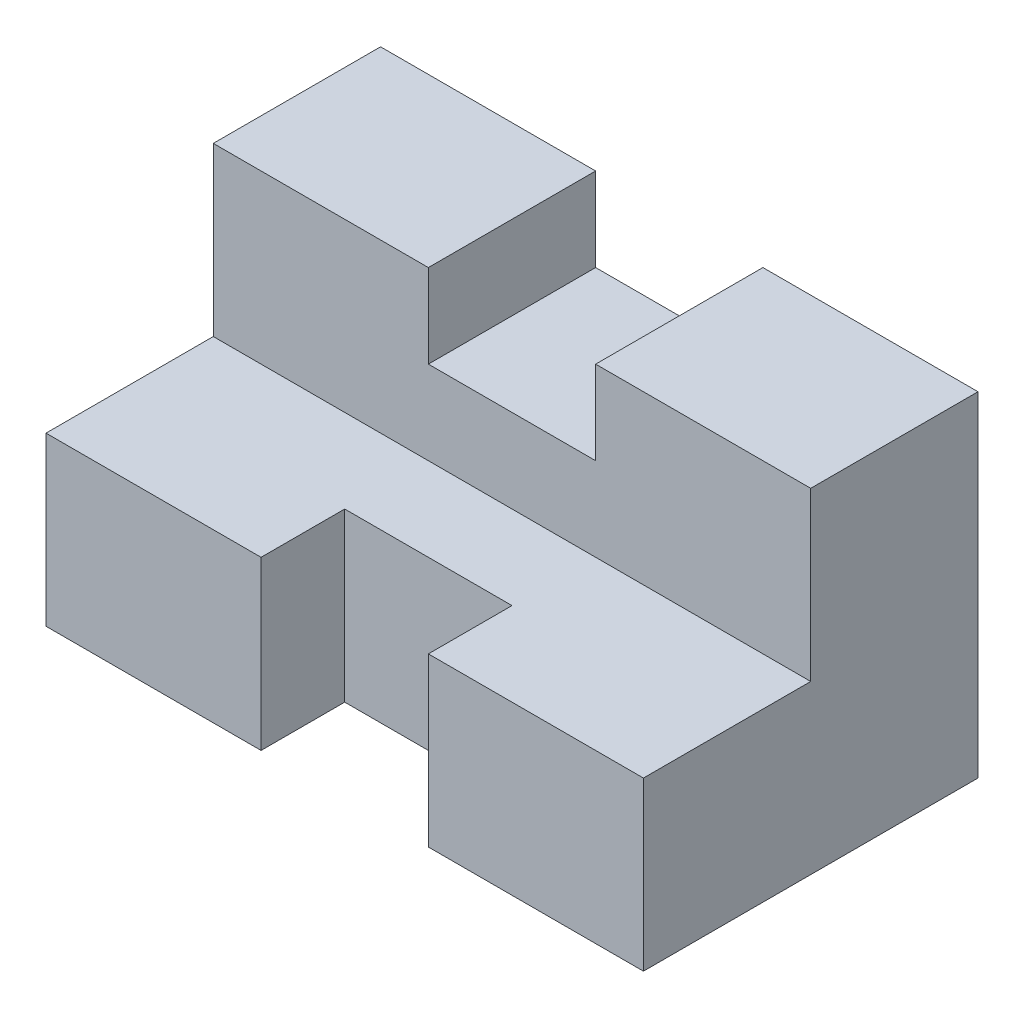
ISO-10303-21;
HEADER;
FILE_DESCRIPTION(('STEP AP214'),'2;1');
FILE_NAME('part.step','',(''),(''),'','','');
FILE_SCHEMA(('AUTOMOTIVE_DESIGN { 1 0 10303 214 1 1 1 1 }'));
ENDSEC;
DATA;
#1=APPLICATION_CONTEXT('core data for automotive mechanical design processes');
#2=APPLICATION_PROTOCOL_DEFINITION('international standard','automotive_design',2000,#1);
#3=PRODUCT_CONTEXT('',#1,'mechanical');
#4=PRODUCT('Part','Part','',(#3));
#5=PRODUCT_RELATED_PRODUCT_CATEGORY('part','',(#4));
#6=PRODUCT_DEFINITION_FORMATION('','',#4);
#7=PRODUCT_DEFINITION_CONTEXT('part definition',#1,'design');
#8=PRODUCT_DEFINITION('design','',#6,#7);
#9=PRODUCT_DEFINITION_SHAPE('','',#8);
#10=(LENGTH_UNIT() NAMED_UNIT(*) SI_UNIT(.MILLI.,.METRE.));
#11=(NAMED_UNIT(*) PLANE_ANGLE_UNIT() SI_UNIT($,.RADIAN.));
#12=(NAMED_UNIT(*) SI_UNIT($,.STERADIAN.) SOLID_ANGLE_UNIT());
#13=UNCERTAINTY_MEASURE_WITH_UNIT(LENGTH_MEASURE(1.E-05),#10,'distance_accuracy_value','');
#14=(GEOMETRIC_REPRESENTATION_CONTEXT(3) GLOBAL_UNCERTAINTY_ASSIGNED_CONTEXT((#13)) GLOBAL_UNIT_ASSIGNED_CONTEXT((#10,
#11,#12)) REPRESENTATION_CONTEXT('',''));
#15=CARTESIAN_POINT('',(0.,0.,0.));
#16=DIRECTION('',(0.,0.,1.));
#17=DIRECTION('',(1.,0.,0.));
#18=AXIS2_PLACEMENT_3D('',#15,#16,#17);
#19=CARTESIAN_POINT('',(25.,28.,-28.));
#20=DIRECTION('',(0.,-1.,0.));
#21=DIRECTION('',(0.,0.,-1.));
#22=AXIS2_PLACEMENT_3D('',#19,#20,#21);
#23=PLANE('',#22);
#24=DIRECTION('',(-1.,0.,0.));
#25=VECTOR('',#24,1.);
#26=CARTESIAN_POINT('',(25.,28.,-14.));
#27=LINE('',#26,#25);
#28=CARTESIAN_POINT('',(-7.,28.,-14.));
#29=VERTEX_POINT('',#28);
#30=CARTESIAN_POINT('',(-25.,28.,-14.));
#31=VERTEX_POINT('',#30);
#32=EDGE_CURVE('E223',#29,#31,#27,.T.);
#33=ORIENTED_EDGE('',*,*,#32,.F.);
#34=DIRECTION('',(0.,0.,1.));
#35=VECTOR('',#34,1.);
#36=CARTESIAN_POINT('',(-7.,28.,-28.));
#37=LINE('',#36,#35);
#38=CARTESIAN_POINT('',(-7.,28.,-28.));
#39=VERTEX_POINT('',#38);
#40=EDGE_CURVE('E159',#39,#29,#37,.T.);
#41=ORIENTED_EDGE('',*,*,#40,.F.);
#42=DIRECTION('',(-1.,0.,0.));
#43=VECTOR('',#42,1.);
#44=CARTESIAN_POINT('',(25.,28.,-28.));
#45=LINE('',#44,#43);
#46=CARTESIAN_POINT('',(-25.,28.,-28.));
#47=VERTEX_POINT('',#46);
#48=EDGE_CURVE('E227',#39,#47,#45,.T.);
#49=ORIENTED_EDGE('',*,*,#48,.T.);
#50=DIRECTION('',(0.,0.,1.));
#51=VECTOR('',#50,1.);
#52=CARTESIAN_POINT('',(-25.,28.,-28.));
#53=LINE('',#52,#51);
#54=EDGE_CURVE('E210',#47,#31,#53,.T.);
#55=ORIENTED_EDGE('',*,*,#54,.T.);
#56=EDGE_LOOP('',(#33,#41,#49,#55));
#57=FACE_BOUND('',#56,.T.);
#58=ADVANCED_FACE('F33',(#57),#23,.F.);
#59=CARTESIAN_POINT('',(25.,14.,0.));
#60=DIRECTION('',(0.,0.,-1.));
#61=DIRECTION('',(-1.,0.,0.));
#62=AXIS2_PLACEMENT_3D('',#59,#60,#61);
#63=PLANE('',#62);
#64=DIRECTION('',(0.,-1.,0.));
#65=VECTOR('',#64,1.);
#66=CARTESIAN_POINT('',(7.,28.001,0.));
#67=LINE('',#66,#65);
#68=CARTESIAN_POINT('',(7.,14.,0.));
#69=VERTEX_POINT('',#68);
#70=CARTESIAN_POINT('',(7.,0.,0.));
#71=VERTEX_POINT('',#70);
#72=EDGE_CURVE('E181',#69,#71,#67,.T.);
#73=ORIENTED_EDGE('',*,*,#72,.T.);
#74=DIRECTION('',(-1.,0.,0.));
#75=VECTOR('',#74,1.);
#76=CARTESIAN_POINT('',(25.,0.,0.));
#77=LINE('',#76,#75);
#78=CARTESIAN_POINT('',(25.,0.,0.));
#79=VERTEX_POINT('',#78);
#80=EDGE_CURVE('E234',#79,#71,#77,.T.);
#81=ORIENTED_EDGE('',*,*,#80,.F.);
#82=DIRECTION('',(0.,-1.,0.));
#83=VECTOR('',#82,1.);
#84=CARTESIAN_POINT('',(25.,14.,0.));
#85=LINE('',#84,#83);
#86=CARTESIAN_POINT('',(25.,14.,0.));
#87=VERTEX_POINT('',#86);
#88=EDGE_CURVE('E188',#87,#79,#85,.T.);
#89=ORIENTED_EDGE('',*,*,#88,.F.);
#90=DIRECTION('',(-1.,0.,0.));
#91=VECTOR('',#90,1.);
#92=CARTESIAN_POINT('',(25.,14.,0.));
#93=LINE('',#92,#91);
#94=EDGE_CURVE('E217',#87,#69,#93,.T.);
#95=ORIENTED_EDGE('',*,*,#94,.T.);
#96=EDGE_LOOP('',(#73,#81,#89,#95));
#97=FACE_BOUND('',#96,.T.);
#98=ADVANCED_FACE('F35',(#97),#63,.F.);
#99=DIRECTION('',(0.,-1.,0.));
#100=VECTOR('',#99,1.);
#101=CARTESIAN_POINT('',(-7.,28.001,0.));
#102=LINE('',#101,#100);
#103=CARTESIAN_POINT('',(-7.,14.,0.));
#104=VERTEX_POINT('',#103);
#105=CARTESIAN_POINT('',(-7.,0.,0.));
#106=VERTEX_POINT('',#105);
#107=EDGE_CURVE('E176',#104,#106,#102,.T.);
#108=ORIENTED_EDGE('',*,*,#107,.F.);
#109=CARTESIAN_POINT('',(-25.,14.,0.));
#110=VERTEX_POINT('',#109);
#111=EDGE_CURVE('E202',#104,#110,#93,.T.);
#112=ORIENTED_EDGE('',*,*,#111,.T.);
#113=DIRECTION('',(0.,-1.,0.));
#114=VECTOR('',#113,1.);
#115=CARTESIAN_POINT('',(-25.,14.,0.));
#116=LINE('',#115,#114);
#117=CARTESIAN_POINT('',(-25.,0.,0.));
#118=VERTEX_POINT('',#117);
#119=EDGE_CURVE('E187',#110,#118,#116,.T.);
#120=ORIENTED_EDGE('',*,*,#119,.T.);
#121=EDGE_CURVE('E233',#106,#118,#77,.T.);
#122=ORIENTED_EDGE('',*,*,#121,.F.);
#123=EDGE_LOOP('',(#108,#112,#120,#122));
#124=FACE_BOUND('',#123,.T.);
#125=ADVANCED_FACE('F264',(#124),#63,.F.);
#126=CARTESIAN_POINT('',(25.,0.,0.));
#127=DIRECTION('',(0.,1.,0.));
#128=DIRECTION('',(0.,0.,1.));
#129=AXIS2_PLACEMENT_3D('',#126,#127,#128);
#130=PLANE('',#129);
#131=DIRECTION('',(0.,0.,-1.));
#132=VECTOR('',#131,1.);
#133=CARTESIAN_POINT('',(7.,0.,0.));
#134=LINE('',#133,#132);
#135=CARTESIAN_POINT('',(7.,0.,-7.));
#136=VERTEX_POINT('',#135);
#137=EDGE_CURVE('E167',#71,#136,#134,.T.);
#138=ORIENTED_EDGE('',*,*,#137,.T.);
#139=DIRECTION('',(-1.,0.,0.));
#140=VECTOR('',#139,1.);
#141=CARTESIAN_POINT('',(7.,0.,-7.));
#142=LINE('',#141,#140);
#143=CARTESIAN_POINT('',(-7.,0.,-7.));
#144=VERTEX_POINT('',#143);
#145=EDGE_CURVE('E170',#136,#144,#142,.T.);
#146=ORIENTED_EDGE('',*,*,#145,.T.);
#147=DIRECTION('',(0.,0.,1.));
#148=VECTOR('',#147,1.);
#149=CARTESIAN_POINT('',(-7.,0.,-7.));
#150=LINE('',#149,#148);
#151=EDGE_CURVE('E173',#144,#106,#150,.T.);
#152=ORIENTED_EDGE('',*,*,#151,.T.);
#153=ORIENTED_EDGE('',*,*,#121,.T.);
#154=DIRECTION('',(0.,0.,-1.));
#155=VECTOR('',#154,1.);
#156=CARTESIAN_POINT('',(-25.,0.,0.));
#157=LINE('',#156,#155);
#158=CARTESIAN_POINT('',(-25.,0.,-28.));
#159=VERTEX_POINT('',#158);
#160=EDGE_CURVE('E205',#118,#159,#157,.T.);
#161=ORIENTED_EDGE('',*,*,#160,.T.);
#162=DIRECTION('',(-1.,0.,0.));
#163=VECTOR('',#162,1.);
#164=CARTESIAN_POINT('',(25.,0.,-28.));
#165=LINE('',#164,#163);
#166=CARTESIAN_POINT('',(25.,0.,-28.));
#167=VERTEX_POINT('',#166);
#168=EDGE_CURVE('E230',#167,#159,#165,.T.);
#169=ORIENTED_EDGE('',*,*,#168,.F.);
#170=DIRECTION('',(0.,0.,-1.));
#171=VECTOR('',#170,1.);
#172=CARTESIAN_POINT('',(25.,0.,0.));
#173=LINE('',#172,#171);
#174=EDGE_CURVE('E191',#79,#167,#173,.T.);
#175=ORIENTED_EDGE('',*,*,#174,.F.);
#176=ORIENTED_EDGE('',*,*,#80,.T.);
#177=EDGE_LOOP('',(#138,#146,#152,#153,#161,#169,#175,#176));
#178=FACE_BOUND('',#177,.T.);
#179=ADVANCED_FACE('F254',(#178),#130,.F.);
#180=CARTESIAN_POINT('',(25.,14.,-14.));
#181=DIRECTION('',(0.,-1.,0.));
#182=DIRECTION('',(0.,0.,-1.));
#183=AXIS2_PLACEMENT_3D('',#180,#181,#182);
#184=PLANE('',#183);
#185=DIRECTION('',(0.,0.,1.));
#186=VECTOR('',#185,1.);
#187=CARTESIAN_POINT('',(7.,14.,0.));
#188=LINE('',#187,#186);
#189=CARTESIAN_POINT('',(7.,14.,-7.));
#190=VERTEX_POINT('',#189);
#191=EDGE_CURVE('E164',#190,#69,#188,.T.);
#192=ORIENTED_EDGE('',*,*,#191,.T.);
#193=ORIENTED_EDGE('',*,*,#94,.F.);
#194=DIRECTION('',(0.,0.,1.));
#195=VECTOR('',#194,1.);
#196=CARTESIAN_POINT('',(25.,14.,-14.));
#197=LINE('',#196,#195);
#198=CARTESIAN_POINT('',(25.,14.,-14.));
#199=VERTEX_POINT('',#198);
#200=EDGE_CURVE('E200',#199,#87,#197,.T.);
#201=ORIENTED_EDGE('',*,*,#200,.F.);
#202=DIRECTION('',(-1.,0.,0.));
#203=VECTOR('',#202,1.);
#204=CARTESIAN_POINT('',(25.,14.,-14.));
#205=LINE('',#204,#203);
#206=CARTESIAN_POINT('',(-25.,14.,-14.));
#207=VERTEX_POINT('',#206);
#208=EDGE_CURVE('E220',#199,#207,#205,.T.);
#209=ORIENTED_EDGE('',*,*,#208,.T.);
#210=DIRECTION('',(0.,0.,1.));
#211=VECTOR('',#210,1.);
#212=CARTESIAN_POINT('',(-25.,14.,-14.));
#213=LINE('',#212,#211);
#214=EDGE_CURVE('E192',#207,#110,#213,.T.);
#215=ORIENTED_EDGE('',*,*,#214,.T.);
#216=ORIENTED_EDGE('',*,*,#111,.F.);
#217=DIRECTION('',(0.,0.,-1.));
#218=VECTOR('',#217,1.);
#219=CARTESIAN_POINT('',(-7.,14.,-7.));
#220=LINE('',#219,#218);
#221=CARTESIAN_POINT('',(-7.,14.,-7.));
#222=VERTEX_POINT('',#221);
#223=EDGE_CURVE('E184',#104,#222,#220,.T.);
#224=ORIENTED_EDGE('',*,*,#223,.T.);
#225=DIRECTION('',(1.,0.,0.));
#226=VECTOR('',#225,1.);
#227=CARTESIAN_POINT('',(7.,14.,-7.));
#228=LINE('',#227,#226);
#229=EDGE_CURVE('E158',#222,#190,#228,.T.);
#230=ORIENTED_EDGE('',*,*,#229,.T.);
#231=EDGE_LOOP('',(#192,#193,#201,#209,#215,#216,#224,#230));
#232=FACE_BOUND('',#231,.T.);
#233=ADVANCED_FACE('F267',(#232),#184,.F.);
#234=CARTESIAN_POINT('',(25.,0.,-28.));
#235=DIRECTION('',(0.,0.,1.));
#236=DIRECTION('',(1.,0.,0.));
#237=AXIS2_PLACEMENT_3D('',#234,#235,#236);
#238=PLANE('',#237);
#239=ORIENTED_EDGE('',*,*,#48,.F.);
#240=DIRECTION('',(0.,-1.,0.));
#241=VECTOR('',#240,1.);
#242=CARTESIAN_POINT('',(-7.,21.,-28.));
#243=LINE('',#242,#241);
#244=CARTESIAN_POINT('',(-7.,21.,-28.));
#245=VERTEX_POINT('',#244);
#246=EDGE_CURVE('E141',#39,#245,#243,.T.);
#247=ORIENTED_EDGE('',*,*,#246,.T.);
#248=DIRECTION('',(1.,0.,0.));
#249=VECTOR('',#248,1.);
#250=CARTESIAN_POINT('',(7.,21.,-28.));
#251=LINE('',#250,#249);
#252=CARTESIAN_POINT('',(7.,21.,-28.));
#253=VERTEX_POINT('',#252);
#254=EDGE_CURVE('E136',#245,#253,#251,.T.);
#255=ORIENTED_EDGE('',*,*,#254,.T.);
#256=DIRECTION('',(0.,1.,0.));
#257=VECTOR('',#256,1.);
#258=CARTESIAN_POINT('',(7.,21.,-28.));
#259=LINE('',#258,#257);
#260=CARTESIAN_POINT('',(7.,28.,-28.));
#261=VERTEX_POINT('',#260);
#262=EDGE_CURVE('E144',#253,#261,#259,.T.);
#263=ORIENTED_EDGE('',*,*,#262,.T.);
#264=CARTESIAN_POINT('',(25.,28.,-28.));
#265=VERTEX_POINT('',#264);
#266=EDGE_CURVE('E228',#265,#261,#45,.T.);
#267=ORIENTED_EDGE('',*,*,#266,.F.);
#268=DIRECTION('',(0.,1.,0.));
#269=VECTOR('',#268,1.);
#270=CARTESIAN_POINT('',(25.,0.,-28.));
#271=LINE('',#270,#269);
#272=EDGE_CURVE('E194',#167,#265,#271,.T.);
#273=ORIENTED_EDGE('',*,*,#272,.F.);
#274=ORIENTED_EDGE('',*,*,#168,.T.);
#275=DIRECTION('',(0.,1.,0.));
#276=VECTOR('',#275,1.);
#277=CARTESIAN_POINT('',(-25.,0.,-28.));
#278=LINE('',#277,#276);
#279=EDGE_CURVE('E207',#159,#47,#278,.T.);
#280=ORIENTED_EDGE('',*,*,#279,.T.);
#281=EDGE_LOOP('',(#239,#247,#255,#263,#267,#273,#274,#280));
#282=FACE_BOUND('',#281,.T.);
#283=ADVANCED_FACE('F152',(#282),#238,.F.);
#284=ORIENTED_EDGE('',*,*,#266,.T.);
#285=DIRECTION('',(0.,0.,1.));
#286=VECTOR('',#285,1.);
#287=CARTESIAN_POINT('',(7.,28.,-28.));
#288=LINE('',#287,#286);
#289=CARTESIAN_POINT('',(7.,28.,-14.));
#290=VERTEX_POINT('',#289);
#291=EDGE_CURVE('E140',#261,#290,#288,.T.);
#292=ORIENTED_EDGE('',*,*,#291,.T.);
#293=CARTESIAN_POINT('',(25.,28.,-14.));
#294=VERTEX_POINT('',#293);
#295=EDGE_CURVE('E224',#294,#290,#27,.T.);
#296=ORIENTED_EDGE('',*,*,#295,.F.);
#297=DIRECTION('',(0.,0.,1.));
#298=VECTOR('',#297,1.);
#299=CARTESIAN_POINT('',(25.,28.,-28.));
#300=LINE('',#299,#298);
#301=EDGE_CURVE('E196',#265,#294,#300,.T.);
#302=ORIENTED_EDGE('',*,*,#301,.F.);
#303=EDGE_LOOP('',(#284,#292,#296,#302));
#304=FACE_BOUND('',#303,.T.);
#305=ADVANCED_FACE('F244',(#304),#23,.F.);
#306=CARTESIAN_POINT('',(25.,28.,-14.));
#307=DIRECTION('',(0.,0.,-1.));
#308=DIRECTION('',(0.,1.,0.));
#309=AXIS2_PLACEMENT_3D('',#306,#307,#308);
#310=PLANE('',#309);
#311=DIRECTION('',(-1.,0.,0.));
#312=VECTOR('',#311,1.);
#313=CARTESIAN_POINT('',(25.,21.,-14.));
#314=LINE('',#313,#312);
#315=CARTESIAN_POINT('',(7.,21.,-14.));
#316=VERTEX_POINT('',#315);
#317=CARTESIAN_POINT('',(-7.,21.,-14.));
#318=VERTEX_POINT('',#317);
#319=EDGE_CURVE('E41',#316,#318,#314,.T.);
#320=ORIENTED_EDGE('',*,*,#319,.T.);
#321=DIRECTION('',(0.,1.,0.));
#322=VECTOR('',#321,1.);
#323=CARTESIAN_POINT('',(-7.,28.,-14.));
#324=LINE('',#323,#322);
#325=EDGE_CURVE('E11',#318,#29,#324,.T.);
#326=ORIENTED_EDGE('',*,*,#325,.T.);
#327=ORIENTED_EDGE('',*,*,#32,.T.);
#328=DIRECTION('',(0.,-1.,0.));
#329=VECTOR('',#328,1.);
#330=CARTESIAN_POINT('',(-25.,28.,-14.));
#331=LINE('',#330,#329);
#332=EDGE_CURVE('E213',#31,#207,#331,.T.);
#333=ORIENTED_EDGE('',*,*,#332,.T.);
#334=ORIENTED_EDGE('',*,*,#208,.F.);
#335=DIRECTION('',(0.,-1.,0.));
#336=VECTOR('',#335,1.);
#337=CARTESIAN_POINT('',(25.,28.,-14.));
#338=LINE('',#337,#336);
#339=EDGE_CURVE('E198',#294,#199,#338,.T.);
#340=ORIENTED_EDGE('',*,*,#339,.F.);
#341=ORIENTED_EDGE('',*,*,#295,.T.);
#342=DIRECTION('',(0.,-1.,0.));
#343=VECTOR('',#342,1.);
#344=CARTESIAN_POINT('',(7.,28.,-14.));
#345=LINE('',#344,#343);
#346=EDGE_CURVE('E237',#290,#316,#345,.T.);
#347=ORIENTED_EDGE('',*,*,#346,.T.);
#348=EDGE_LOOP('',(#320,#326,#327,#333,#334,#340,#341,#347));
#349=FACE_BOUND('',#348,.T.);
#350=ADVANCED_FACE('F239',(#349),#310,.F.);
#351=CARTESIAN_POINT('',(25.,0.,0.));
#352=DIRECTION('',(1.,0.,0.));
#353=DIRECTION('',(0.,0.,-1.));
#354=AXIS2_PLACEMENT_3D('',#351,#352,#353);
#355=PLANE('',#354);
#356=ORIENTED_EDGE('',*,*,#88,.T.);
#357=ORIENTED_EDGE('',*,*,#174,.T.);
#358=ORIENTED_EDGE('',*,*,#272,.T.);
#359=ORIENTED_EDGE('',*,*,#301,.T.);
#360=ORIENTED_EDGE('',*,*,#339,.T.);
#361=ORIENTED_EDGE('',*,*,#200,.T.);
#362=EDGE_LOOP('',(#356,#357,#358,#359,#360,#361));
#363=FACE_BOUND('',#362,.T.);
#364=ADVANCED_FACE('F250',(#363),#355,.T.);
#365=CARTESIAN_POINT('',(-25.,0.,0.));
#366=DIRECTION('',(1.,0.,0.));
#367=DIRECTION('',(0.,0.,-1.));
#368=AXIS2_PLACEMENT_3D('',#365,#366,#367);
#369=PLANE('',#368);
#370=ORIENTED_EDGE('',*,*,#119,.F.);
#371=ORIENTED_EDGE('',*,*,#214,.F.);
#372=ORIENTED_EDGE('',*,*,#332,.F.);
#373=ORIENTED_EDGE('',*,*,#54,.F.);
#374=ORIENTED_EDGE('',*,*,#279,.F.);
#375=ORIENTED_EDGE('',*,*,#160,.F.);
#376=EDGE_LOOP('',(#370,#371,#372,#373,#374,#375));
#377=FACE_BOUND('',#376,.T.);
#378=ADVANCED_FACE('F259',(#377),#369,.F.);
#379=CARTESIAN_POINT('',(7.,28.001,0.));
#380=DIRECTION('',(-1.,0.,0.));
#381=DIRECTION('',(0.,0.,1.));
#382=AXIS2_PLACEMENT_3D('',#379,#380,#381);
#383=PLANE('',#382);
#384=DIRECTION('',(0.,-1.,0.));
#385=VECTOR('',#384,1.);
#386=CARTESIAN_POINT('',(7.,28.001,-7.));
#387=LINE('',#386,#385);
#388=EDGE_CURVE('E179',#190,#136,#387,.T.);
#389=ORIENTED_EDGE('',*,*,#388,.T.);
#390=ORIENTED_EDGE('',*,*,#137,.F.);
#391=ORIENTED_EDGE('',*,*,#72,.F.);
#392=ORIENTED_EDGE('',*,*,#191,.F.);
#393=EDGE_LOOP('',(#389,#390,#391,#392));
#394=FACE_BOUND('',#393,.T.);
#395=ADVANCED_FACE('F321',(#394),#383,.T.);
#396=CARTESIAN_POINT('',(7.,28.001,-7.));
#397=DIRECTION('',(0.,0.,1.));
#398=DIRECTION('',(1.,0.,0.));
#399=AXIS2_PLACEMENT_3D('',#396,#397,#398);
#400=PLANE('',#399);
#401=DIRECTION('',(0.,-1.,0.));
#402=VECTOR('',#401,1.);
#403=CARTESIAN_POINT('',(-7.,28.001,-7.));
#404=LINE('',#403,#402);
#405=EDGE_CURVE('E56',#222,#144,#404,.T.);
#406=ORIENTED_EDGE('',*,*,#405,.T.);
#407=ORIENTED_EDGE('',*,*,#145,.F.);
#408=ORIENTED_EDGE('',*,*,#388,.F.);
#409=ORIENTED_EDGE('',*,*,#229,.F.);
#410=EDGE_LOOP('',(#406,#407,#408,#409));
#411=FACE_BOUND('',#410,.T.);
#412=ADVANCED_FACE('F364',(#411),#400,.T.);
#413=CARTESIAN_POINT('',(-7.,28.001,-7.));
#414=DIRECTION('',(1.,0.,0.));
#415=DIRECTION('',(0.,0.,-1.));
#416=AXIS2_PLACEMENT_3D('',#413,#414,#415);
#417=PLANE('',#416);
#418=ORIENTED_EDGE('',*,*,#107,.T.);
#419=ORIENTED_EDGE('',*,*,#151,.F.);
#420=ORIENTED_EDGE('',*,*,#405,.F.);
#421=ORIENTED_EDGE('',*,*,#223,.F.);
#422=EDGE_LOOP('',(#418,#419,#420,#421));
#423=FACE_BOUND('',#422,.T.);
#424=ADVANCED_FACE('F282',(#423),#417,.T.);
#425=CARTESIAN_POINT('',(7.,21.,-28.));
#426=DIRECTION('',(0.,-1.,0.));
#427=DIRECTION('',(0.,0.,-1.));
#428=AXIS2_PLACEMENT_3D('',#425,#426,#427);
#429=PLANE('',#428);
#430=DIRECTION('',(0.,0.,1.));
#431=VECTOR('',#430,1.);
#432=CARTESIAN_POINT('',(7.,21.,-28.));
#433=LINE('',#432,#431);
#434=EDGE_CURVE('E48',#253,#316,#433,.T.);
#435=ORIENTED_EDGE('',*,*,#434,.F.);
#436=ORIENTED_EDGE('',*,*,#254,.F.);
#437=DIRECTION('',(0.,0.,1.));
#438=VECTOR('',#437,1.);
#439=CARTESIAN_POINT('',(-7.,21.,-28.));
#440=LINE('',#439,#438);
#441=EDGE_CURVE('E156',#245,#318,#440,.T.);
#442=ORIENTED_EDGE('',*,*,#441,.T.);
#443=ORIENTED_EDGE('',*,*,#319,.F.);
#444=EDGE_LOOP('',(#435,#436,#442,#443));
#445=FACE_BOUND('',#444,.T.);
#446=ADVANCED_FACE('F133',(#445),#429,.F.);
#447=CARTESIAN_POINT('',(-7.,21.,-28.));
#448=DIRECTION('',(-1.,0.,0.));
#449=DIRECTION('',(0.,0.,1.));
#450=AXIS2_PLACEMENT_3D('',#447,#448,#449);
#451=PLANE('',#450);
#452=ORIENTED_EDGE('',*,*,#441,.F.);
#453=ORIENTED_EDGE('',*,*,#246,.F.);
#454=ORIENTED_EDGE('',*,*,#40,.T.);
#455=ORIENTED_EDGE('',*,*,#325,.F.);
#456=EDGE_LOOP('',(#452,#453,#454,#455));
#457=FACE_BOUND('',#456,.T.);
#458=ADVANCED_FACE('F274',(#457),#451,.F.);
#459=CARTESIAN_POINT('',(7.,21.,-28.));
#460=DIRECTION('',(1.,0.,0.));
#461=DIRECTION('',(0.,0.,-1.));
#462=AXIS2_PLACEMENT_3D('',#459,#460,#461);
#463=PLANE('',#462);
#464=ORIENTED_EDGE('',*,*,#291,.F.);
#465=ORIENTED_EDGE('',*,*,#262,.F.);
#466=ORIENTED_EDGE('',*,*,#434,.T.);
#467=ORIENTED_EDGE('',*,*,#346,.F.);
#468=EDGE_LOOP('',(#464,#465,#466,#467));
#469=FACE_BOUND('',#468,.T.);
#470=ADVANCED_FACE('F145',(#469),#463,.F.);
#471=CLOSED_SHELL('',(#58,#98,#125,#179,#233,#283,#305,#350,#364,#378,#395,#412,#424,#446,#458,#470));
#472=MANIFOLD_SOLID_BREP('B2',#471);
#473=ADVANCED_BREP_SHAPE_REPRESENTATION('',(#18,#472),#14);
#474=SHAPE_DEFINITION_REPRESENTATION(#9,#473);
ENDSEC;
END-ISO-10303-21;
